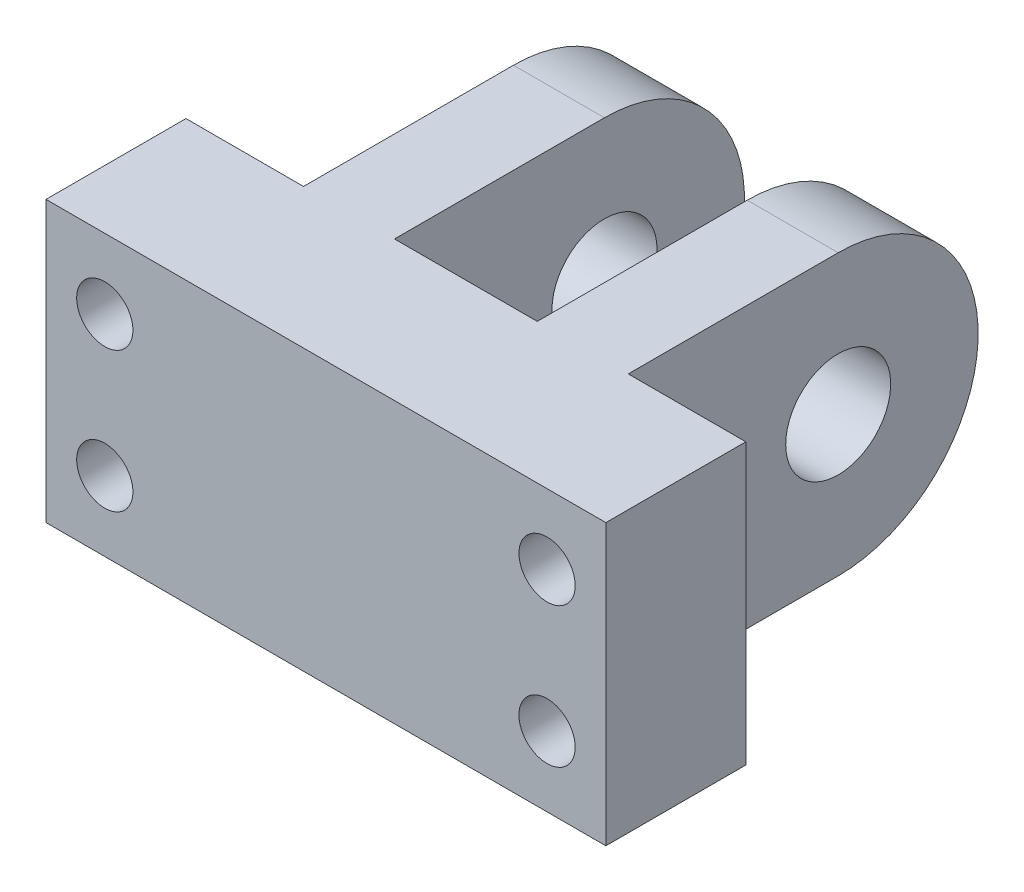
ISO-10303-21;
HEADER;
FILE_DESCRIPTION(('STEP AP214'),'2;1');
FILE_NAME('part.step','',(''),(''),'','','');
FILE_SCHEMA(('AUTOMOTIVE_DESIGN { 1 0 10303 214 1 1 1 1 }'));
ENDSEC;
DATA;
#1=APPLICATION_CONTEXT('core data for automotive mechanical design processes');
#2=APPLICATION_PROTOCOL_DEFINITION('international standard','automotive_design',2000,#1);
#3=PRODUCT_CONTEXT('',#1,'mechanical');
#4=PRODUCT('Part','Part','',(#3));
#5=PRODUCT_RELATED_PRODUCT_CATEGORY('part','',(#4));
#6=PRODUCT_DEFINITION_FORMATION('','',#4);
#7=PRODUCT_DEFINITION_CONTEXT('part definition',#1,'design');
#8=PRODUCT_DEFINITION('design','',#6,#7);
#9=PRODUCT_DEFINITION_SHAPE('','',#8);
#10=(LENGTH_UNIT() NAMED_UNIT(*) SI_UNIT(.MILLI.,.METRE.));
#11=(NAMED_UNIT(*) PLANE_ANGLE_UNIT() SI_UNIT($,.RADIAN.));
#12=(NAMED_UNIT(*) SI_UNIT($,.STERADIAN.) SOLID_ANGLE_UNIT());
#13=UNCERTAINTY_MEASURE_WITH_UNIT(LENGTH_MEASURE(1.E-05),#10,'distance_accuracy_value','');
#14=(GEOMETRIC_REPRESENTATION_CONTEXT(3) GLOBAL_UNCERTAINTY_ASSIGNED_CONTEXT((#13)) GLOBAL_UNIT_ASSIGNED_CONTEXT((#10,
#11,#12)) REPRESENTATION_CONTEXT('',''));
#15=CARTESIAN_POINT('',(0.,0.,0.));
#16=DIRECTION('',(0.,0.,1.));
#17=DIRECTION('',(1.,0.,0.));
#18=AXIS2_PLACEMENT_3D('',#15,#16,#17);
#19=CARTESIAN_POINT('',(50.8,12.7,-31.75));
#20=DIRECTION('',(-1.,0.,0.));
#21=DIRECTION('',(0.,0.,1.));
#22=AXIS2_PLACEMENT_3D('',#19,#20,#21);
#23=CYLINDRICAL_SURFACE('',#22,12.7);
#24=DIRECTION('',(-1.,0.,0.));
#25=VECTOR('',#24,1.);
#26=CARTESIAN_POINT('',(50.8,0.,-31.75));
#27=LINE('',#26,#25);
#28=CARTESIAN_POINT('',(18.923,0.,-31.75));
#29=VERTEX_POINT('',#28);
#30=CARTESIAN_POINT('',(10.668,0.,-31.75));
#31=VERTEX_POINT('',#30);
#32=EDGE_CURVE('E173',#29,#31,#27,.T.);
#33=ORIENTED_EDGE('',*,*,#32,.T.);
#34=CARTESIAN_POINT('',(10.668,12.7,-31.75));
#35=DIRECTION('',(1.,0.,0.));
#36=DIRECTION('',(0.,0.,-1.));
#37=AXIS2_PLACEMENT_3D('',#34,#35,#36);
#38=CIRCLE('',#37,12.7);
#39=CARTESIAN_POINT('',(10.668,25.4,-31.75));
#40=VERTEX_POINT('',#39);
#41=EDGE_CURVE('E165',#31,#40,#38,.T.);
#42=ORIENTED_EDGE('',*,*,#41,.T.);
#43=DIRECTION('',(-1.,0.,0.));
#44=VECTOR('',#43,1.);
#45=CARTESIAN_POINT('',(50.8,25.4,-31.75));
#46=LINE('',#45,#44);
#47=CARTESIAN_POINT('',(18.923,25.4,-31.75));
#48=VERTEX_POINT('',#47);
#49=EDGE_CURVE('E155',#48,#40,#46,.T.);
#50=ORIENTED_EDGE('',*,*,#49,.F.);
#51=CARTESIAN_POINT('',(18.923,12.7,-31.75));
#52=DIRECTION('',(-1.,0.,0.));
#53=DIRECTION('',(0.,0.,1.));
#54=AXIS2_PLACEMENT_3D('',#51,#52,#53);
#55=CIRCLE('',#54,12.7);
#56=EDGE_CURVE('E186',#48,#29,#55,.T.);
#57=ORIENTED_EDGE('',*,*,#56,.T.);
#58=EDGE_LOOP('',(#33,#42,#50,#57));
#59=FACE_BOUND('',#58,.T.);
#60=ADVANCED_FACE('F35',(#59),#23,.T.);
#61=CARTESIAN_POINT('',(50.8,12.7,-31.75));
#62=DIRECTION('',(-1.,0.,0.));
#63=DIRECTION('',(0.,0.,1.));
#64=AXIS2_PLACEMENT_3D('',#61,#62,#63);
#65=PLANE('',#64);
#66=DIRECTION('',(0.,0.,-1.));
#67=VECTOR('',#66,1.);
#68=CARTESIAN_POINT('',(50.8,0.,0.));
#69=LINE('',#68,#67);
#70=CARTESIAN_POINT('',(50.8,0.,0.));
#71=VERTEX_POINT('',#70);
#72=CARTESIAN_POINT('',(50.8,0.,-12.7));
#73=VERTEX_POINT('',#72);
#74=EDGE_CURVE('E147',#71,#73,#69,.T.);
#75=ORIENTED_EDGE('',*,*,#74,.T.);
#76=DIRECTION('',(0.,-1.,0.));
#77=VECTOR('',#76,1.);
#78=CARTESIAN_POINT('',(50.8,25.4,-12.7));
#79=LINE('',#78,#77);
#80=CARTESIAN_POINT('',(50.8,25.4,-12.7));
#81=VERTEX_POINT('',#80);
#82=EDGE_CURVE('E132',#81,#73,#79,.T.);
#83=ORIENTED_EDGE('',*,*,#82,.F.);
#84=DIRECTION('',(0.,0.,1.));
#85=VECTOR('',#84,1.);
#86=CARTESIAN_POINT('',(50.8,25.4,0.));
#87=LINE('',#86,#85);
#88=CARTESIAN_POINT('',(50.8,25.4,0.));
#89=VERTEX_POINT('',#88);
#90=EDGE_CURVE('E145',#81,#89,#87,.T.);
#91=ORIENTED_EDGE('',*,*,#90,.T.);
#92=DIRECTION('',(0.,-1.,0.));
#93=VECTOR('',#92,1.);
#94=CARTESIAN_POINT('',(50.8,0.,0.));
#95=LINE('',#94,#93);
#96=EDGE_CURVE('E157',#89,#71,#95,.T.);
#97=ORIENTED_EDGE('',*,*,#96,.T.);
#98=EDGE_LOOP('',(#75,#83,#91,#97));
#99=FACE_BOUND('',#98,.T.);
#100=ADVANCED_FACE('F143',(#99),#65,.F.);
#101=CARTESIAN_POINT('',(0.,12.7,-31.75));
#102=DIRECTION('',(-1.,0.,0.));
#103=DIRECTION('',(0.,0.,1.));
#104=AXIS2_PLACEMENT_3D('',#101,#102,#103);
#105=PLANE('',#104);
#106=DIRECTION('',(0.,-1.,0.));
#107=VECTOR('',#106,1.);
#108=CARTESIAN_POINT('',(0.,25.4,-12.7));
#109=LINE('',#108,#107);
#110=CARTESIAN_POINT('',(0.,25.4,-12.7));
#111=VERTEX_POINT('',#110);
#112=CARTESIAN_POINT('',(0.,0.,-12.7));
#113=VERTEX_POINT('',#112);
#114=EDGE_CURVE('E180',#111,#113,#109,.T.);
#115=ORIENTED_EDGE('',*,*,#114,.T.);
#116=DIRECTION('',(0.,0.,-1.));
#117=VECTOR('',#116,1.);
#118=CARTESIAN_POINT('',(0.,0.,0.));
#119=LINE('',#118,#117);
#120=CARTESIAN_POINT('',(0.,0.,0.));
#121=VERTEX_POINT('',#120);
#122=EDGE_CURVE('E164',#121,#113,#119,.T.);
#123=ORIENTED_EDGE('',*,*,#122,.F.);
#124=DIRECTION('',(0.,-1.,0.));
#125=VECTOR('',#124,1.);
#126=CARTESIAN_POINT('',(0.,0.,0.));
#127=LINE('',#126,#125);
#128=CARTESIAN_POINT('',(0.,25.4,0.));
#129=VERTEX_POINT('',#128);
#130=EDGE_CURVE('E161',#129,#121,#127,.T.);
#131=ORIENTED_EDGE('',*,*,#130,.F.);
#132=DIRECTION('',(0.,0.,1.));
#133=VECTOR('',#132,1.);
#134=CARTESIAN_POINT('',(0.,25.4,0.));
#135=LINE('',#134,#133);
#136=EDGE_CURVE('E168',#111,#129,#135,.T.);
#137=ORIENTED_EDGE('',*,*,#136,.F.);
#138=EDGE_LOOP('',(#115,#123,#131,#137));
#139=FACE_BOUND('',#138,.T.);
#140=ADVANCED_FACE('F251',(#139),#105,.T.);
#141=CARTESIAN_POINT('',(50.8,0.,0.));
#142=DIRECTION('',(0.,0.,-1.));
#143=DIRECTION('',(-1.,0.,0.));
#144=AXIS2_PLACEMENT_3D('',#141,#142,#143);
#145=PLANE('',#144);
#146=CARTESIAN_POINT('',(45.466,6.34999999999999,0.));
#147=DIRECTION('',(0.,0.,-1.));
#148=DIRECTION('',(0.,1.,0.));
#149=AXIS2_PLACEMENT_3D('',#146,#147,#148);
#150=CIRCLE('',#149,2.5527);
#151=CARTESIAN_POINT('',(45.466,8.90269999999999,0.));
#152=VERTEX_POINT('',#151);
#153=EDGE_CURVE('E372',#152,#152,#150,.T.);
#154=ORIENTED_EDGE('',*,*,#153,.T.);
#155=EDGE_LOOP('',(#154));
#156=FACE_BOUND('',#155,.T.);
#157=CARTESIAN_POINT('',(45.466,19.05,0.));
#158=DIRECTION('',(0.,0.,-1.));
#159=DIRECTION('',(0.,1.,0.));
#160=AXIS2_PLACEMENT_3D('',#157,#158,#159);
#161=CIRCLE('',#160,2.5527);
#162=CARTESIAN_POINT('',(45.466,21.6027,0.));
#163=VERTEX_POINT('',#162);
#164=EDGE_CURVE('E384',#163,#163,#161,.T.);
#165=ORIENTED_EDGE('',*,*,#164,.T.);
#166=EDGE_LOOP('',(#165));
#167=FACE_BOUND('',#166,.T.);
#168=CARTESIAN_POINT('',(5.334,19.05,0.));
#169=DIRECTION('',(0.,0.,-1.));
#170=DIRECTION('',(0.,1.,0.));
#171=AXIS2_PLACEMENT_3D('',#168,#169,#170);
#172=CIRCLE('',#171,2.5527);
#173=CARTESIAN_POINT('',(5.334,21.6027,0.));
#174=VERTEX_POINT('',#173);
#175=EDGE_CURVE('E396',#174,#174,#172,.T.);
#176=ORIENTED_EDGE('',*,*,#175,.T.);
#177=EDGE_LOOP('',(#176));
#178=FACE_BOUND('',#177,.T.);
#179=CARTESIAN_POINT('',(5.334,6.35,0.));
#180=DIRECTION('',(0.,0.,-1.));
#181=DIRECTION('',(0.,1.,0.));
#182=AXIS2_PLACEMENT_3D('',#179,#180,#181);
#183=CIRCLE('',#182,2.5527);
#184=CARTESIAN_POINT('',(5.334,8.9027,0.));
#185=VERTEX_POINT('',#184);
#186=EDGE_CURVE('E208',#185,#185,#183,.T.);
#187=ORIENTED_EDGE('',*,*,#186,.T.);
#188=EDGE_LOOP('',(#187));
#189=FACE_BOUND('',#188,.T.);
#190=ORIENTED_EDGE('',*,*,#130,.T.);
#191=DIRECTION('',(-1.,0.,0.));
#192=VECTOR('',#191,1.);
#193=CARTESIAN_POINT('',(50.8,0.,0.));
#194=LINE('',#193,#192);
#195=EDGE_CURVE('E11',#71,#121,#194,.T.);
#196=ORIENTED_EDGE('',*,*,#195,.F.);
#197=ORIENTED_EDGE('',*,*,#96,.F.);
#198=DIRECTION('',(-1.,0.,0.));
#199=VECTOR('',#198,1.);
#200=CARTESIAN_POINT('',(50.8,25.4,0.));
#201=LINE('',#200,#199);
#202=EDGE_CURVE('E152',#89,#129,#201,.T.);
#203=ORIENTED_EDGE('',*,*,#202,.T.);
#204=EDGE_LOOP('',(#190,#196,#197,#203));
#205=FACE_BOUND('',#204,.T.);
#206=ADVANCED_FACE('F37',(#156,#167,#178,#189,#205),#145,.F.);
#207=CARTESIAN_POINT('',(50.8,0.,0.));
#208=DIRECTION('',(0.,1.,0.));
#209=DIRECTION('',(0.,0.,1.));
#210=AXIS2_PLACEMENT_3D('',#207,#208,#209);
#211=PLANE('',#210);
#212=ORIENTED_EDGE('',*,*,#122,.T.);
#213=DIRECTION('',(-1.,0.,0.));
#214=VECTOR('',#213,1.);
#215=CARTESIAN_POINT('',(10.668,0.,-12.7));
#216=LINE('',#215,#214);
#217=CARTESIAN_POINT('',(10.668,0.,-12.7));
#218=VERTEX_POINT('',#217);
#219=EDGE_CURVE('E139',#218,#113,#216,.T.);
#220=ORIENTED_EDGE('',*,*,#219,.F.);
#221=DIRECTION('',(0.,0.,1.));
#222=VECTOR('',#221,1.);
#223=CARTESIAN_POINT('',(10.668,0.,-44.45));
#224=LINE('',#223,#222);
#225=EDGE_CURVE('E225',#31,#218,#224,.T.);
#226=ORIENTED_EDGE('',*,*,#225,.F.);
#227=ORIENTED_EDGE('',*,*,#32,.F.);
#228=DIRECTION('',(0.,0.,-1.));
#229=VECTOR('',#228,1.);
#230=CARTESIAN_POINT('',(18.923,0.,-12.7));
#231=LINE('',#230,#229);
#232=CARTESIAN_POINT('',(18.923,0.,-12.7));
#233=VERTEX_POINT('',#232);
#234=EDGE_CURVE('E222',#233,#29,#231,.T.);
#235=ORIENTED_EDGE('',*,*,#234,.F.);
#236=DIRECTION('',(-1.,0.,0.));
#237=VECTOR('',#236,1.);
#238=CARTESIAN_POINT('',(31.877,0.,-12.7));
#239=LINE('',#238,#237);
#240=CARTESIAN_POINT('',(31.877,0.,-12.7));
#241=VERTEX_POINT('',#240);
#242=EDGE_CURVE('E219',#241,#233,#239,.T.);
#243=ORIENTED_EDGE('',*,*,#242,.F.);
#244=DIRECTION('',(0.,0.,1.));
#245=VECTOR('',#244,1.);
#246=CARTESIAN_POINT('',(31.877,0.,-44.45));
#247=LINE('',#246,#245);
#248=CARTESIAN_POINT('',(31.877,0.,-31.75));
#249=VERTEX_POINT('',#248);
#250=EDGE_CURVE('E210',#249,#241,#247,.T.);
#251=ORIENTED_EDGE('',*,*,#250,.F.);
#252=CARTESIAN_POINT('',(40.132,0.,-31.75));
#253=VERTEX_POINT('',#252);
#254=EDGE_CURVE('E44',#253,#249,#27,.T.);
#255=ORIENTED_EDGE('',*,*,#254,.F.);
#256=DIRECTION('',(0.,0.,-1.));
#257=VECTOR('',#256,1.);
#258=CARTESIAN_POINT('',(40.132,0.,-12.7));
#259=LINE('',#258,#257);
#260=CARTESIAN_POINT('',(40.132,0.,-12.7));
#261=VERTEX_POINT('',#260);
#262=EDGE_CURVE('E207',#261,#253,#259,.T.);
#263=ORIENTED_EDGE('',*,*,#262,.F.);
#264=DIRECTION('',(-1.,0.,0.));
#265=VECTOR('',#264,1.);
#266=CARTESIAN_POINT('',(50.8,0.,-12.7));
#267=LINE('',#266,#265);
#268=EDGE_CURVE('E204',#73,#261,#267,.T.);
#269=ORIENTED_EDGE('',*,*,#268,.F.);
#270=ORIENTED_EDGE('',*,*,#74,.F.);
#271=ORIENTED_EDGE('',*,*,#195,.T.);
#272=EDGE_LOOP('',(#212,#220,#226,#227,#235,#243,#251,#255,#263,#269,#270,#271));
#273=FACE_BOUND('',#272,.T.);
#274=ADVANCED_FACE('F201',(#273),#211,.F.);
#275=ORIENTED_EDGE('',*,*,#254,.T.);
#276=CARTESIAN_POINT('',(31.877,12.7,-31.75));
#277=DIRECTION('',(1.,0.,0.));
#278=DIRECTION('',(0.,0.,-1.));
#279=AXIS2_PLACEMENT_3D('',#276,#277,#278);
#280=CIRCLE('',#279,12.7);
#281=CARTESIAN_POINT('',(31.877,25.4,-31.75));
#282=VERTEX_POINT('',#281);
#283=EDGE_CURVE('E183',#249,#282,#280,.T.);
#284=ORIENTED_EDGE('',*,*,#283,.T.);
#285=CARTESIAN_POINT('',(40.132,25.4,-31.75));
#286=VERTEX_POINT('',#285);
#287=EDGE_CURVE('E172',#286,#282,#46,.T.);
#288=ORIENTED_EDGE('',*,*,#287,.F.);
#289=CARTESIAN_POINT('',(40.132,12.7,-31.75));
#290=DIRECTION('',(-1.,0.,0.));
#291=DIRECTION('',(0.,0.,1.));
#292=AXIS2_PLACEMENT_3D('',#289,#290,#291);
#293=CIRCLE('',#292,12.7);
#294=EDGE_CURVE('E179',#286,#253,#293,.T.);
#295=ORIENTED_EDGE('',*,*,#294,.T.);
#296=EDGE_LOOP('',(#275,#284,#288,#295));
#297=FACE_BOUND('',#296,.T.);
#298=ADVANCED_FACE('F267',(#297),#23,.T.);
#299=CARTESIAN_POINT('',(50.8,25.4,0.));
#300=DIRECTION('',(0.,-1.,0.));
#301=DIRECTION('',(0.,0.,-1.));
#302=AXIS2_PLACEMENT_3D('',#299,#300,#301);
#303=PLANE('',#302);
#304=DIRECTION('',(0.,0.,1.));
#305=VECTOR('',#304,1.);
#306=CARTESIAN_POINT('',(10.668,25.4,-44.45));
#307=LINE('',#306,#305);
#308=CARTESIAN_POINT('',(10.668,25.4,-12.7));
#309=VERTEX_POINT('',#308);
#310=EDGE_CURVE('E247',#40,#309,#307,.T.);
#311=ORIENTED_EDGE('',*,*,#310,.T.);
#312=DIRECTION('',(-1.,0.,0.));
#313=VECTOR('',#312,1.);
#314=CARTESIAN_POINT('',(10.668,25.4,-12.7));
#315=LINE('',#314,#313);
#316=EDGE_CURVE('E52',#309,#111,#315,.T.);
#317=ORIENTED_EDGE('',*,*,#316,.T.);
#318=ORIENTED_EDGE('',*,*,#136,.T.);
#319=ORIENTED_EDGE('',*,*,#202,.F.);
#320=ORIENTED_EDGE('',*,*,#90,.F.);
#321=DIRECTION('',(-1.,0.,0.));
#322=VECTOR('',#321,1.);
#323=CARTESIAN_POINT('',(50.8,25.4,-12.7));
#324=LINE('',#323,#322);
#325=CARTESIAN_POINT('',(40.132,25.4,-12.7));
#326=VERTEX_POINT('',#325);
#327=EDGE_CURVE('E128',#81,#326,#324,.T.);
#328=ORIENTED_EDGE('',*,*,#327,.T.);
#329=DIRECTION('',(0.,0.,-1.));
#330=VECTOR('',#329,1.);
#331=CARTESIAN_POINT('',(40.132,25.4,-12.7));
#332=LINE('',#331,#330);
#333=EDGE_CURVE('E138',#326,#286,#332,.T.);
#334=ORIENTED_EDGE('',*,*,#333,.T.);
#335=ORIENTED_EDGE('',*,*,#287,.T.);
#336=DIRECTION('',(0.,0.,1.));
#337=VECTOR('',#336,1.);
#338=CARTESIAN_POINT('',(31.877,25.4,-44.45));
#339=LINE('',#338,#337);
#340=CARTESIAN_POINT('',(31.877,25.4,-12.7));
#341=VERTEX_POINT('',#340);
#342=EDGE_CURVE('E239',#282,#341,#339,.T.);
#343=ORIENTED_EDGE('',*,*,#342,.T.);
#344=DIRECTION('',(-1.,0.,0.));
#345=VECTOR('',#344,1.);
#346=CARTESIAN_POINT('',(31.877,25.4,-12.7));
#347=LINE('',#346,#345);
#348=CARTESIAN_POINT('',(18.923,25.4,-12.7));
#349=VERTEX_POINT('',#348);
#350=EDGE_CURVE('E60',#341,#349,#347,.T.);
#351=ORIENTED_EDGE('',*,*,#350,.T.);
#352=DIRECTION('',(0.,0.,-1.));
#353=VECTOR('',#352,1.);
#354=CARTESIAN_POINT('',(18.923,25.4,-12.7));
#355=LINE('',#354,#353);
#356=EDGE_CURVE('E245',#349,#48,#355,.T.);
#357=ORIENTED_EDGE('',*,*,#356,.T.);
#358=ORIENTED_EDGE('',*,*,#49,.T.);
#359=EDGE_LOOP('',(#311,#317,#318,#319,#320,#328,#334,#335,#343,#351,#357,#358));
#360=FACE_BOUND('',#359,.T.);
#361=ADVANCED_FACE('F150',(#360),#303,.F.);
#362=CARTESIAN_POINT('',(40.132,25.4,-12.7));
#363=DIRECTION('',(-1.,0.,0.));
#364=DIRECTION('',(0.,0.,1.));
#365=AXIS2_PLACEMENT_3D('',#362,#363,#364);
#366=PLANE('',#365);
#367=CARTESIAN_POINT('',(40.132,12.7,-31.75));
#368=DIRECTION('',(-1.,0.,0.));
#369=DIRECTION('',(0.,0.,1.));
#370=AXIS2_PLACEMENT_3D('',#367,#368,#369);
#371=CIRCLE('',#370,4.7625);
#372=CARTESIAN_POINT('',(40.132,12.7,-26.9875));
#373=VERTEX_POINT('',#372);
#374=EDGE_CURVE('E176',#373,#373,#371,.T.);
#375=ORIENTED_EDGE('',*,*,#374,.T.);
#376=EDGE_LOOP('',(#375));
#377=FACE_BOUND('',#376,.T.);
#378=ORIENTED_EDGE('',*,*,#333,.F.);
#379=DIRECTION('',(0.,-1.,0.));
#380=VECTOR('',#379,1.);
#381=CARTESIAN_POINT('',(40.132,25.4,-12.7));
#382=LINE('',#381,#380);
#383=EDGE_CURVE('E134',#326,#261,#382,.T.);
#384=ORIENTED_EDGE('',*,*,#383,.T.);
#385=ORIENTED_EDGE('',*,*,#262,.T.);
#386=ORIENTED_EDGE('',*,*,#294,.F.);
#387=EDGE_LOOP('',(#378,#384,#385,#386));
#388=FACE_BOUND('',#387,.T.);
#389=ADVANCED_FACE('F237',(#377,#388),#366,.F.);
#390=CARTESIAN_POINT('',(50.8,25.4,-12.7));
#391=DIRECTION('',(0.,0.,1.));
#392=DIRECTION('',(0.,-1.,0.));
#393=AXIS2_PLACEMENT_3D('',#390,#391,#392);
#394=PLANE('',#393);
#395=CARTESIAN_POINT('',(45.466,6.34999999999999,-12.7));
#396=DIRECTION('',(0.,0.,-1.));
#397=DIRECTION('',(0.,1.,0.));
#398=AXIS2_PLACEMENT_3D('',#395,#396,#397);
#399=CIRCLE('',#398,4.7625);
#400=CARTESIAN_POINT('',(45.466,11.1125,-12.7));
#401=VERTEX_POINT('',#400);
#402=EDGE_CURVE('E365',#401,#401,#399,.T.);
#403=ORIENTED_EDGE('',*,*,#402,.F.);
#404=EDGE_LOOP('',(#403));
#405=FACE_BOUND('',#404,.T.);
#406=CARTESIAN_POINT('',(45.466,19.05,-12.7));
#407=DIRECTION('',(0.,0.,-1.));
#408=DIRECTION('',(0.,1.,0.));
#409=AXIS2_PLACEMENT_3D('',#406,#407,#408);
#410=CIRCLE('',#409,4.7625);
#411=CARTESIAN_POINT('',(45.466,23.8125,-12.7));
#412=VERTEX_POINT('',#411);
#413=EDGE_CURVE('E375',#412,#412,#410,.T.);
#414=ORIENTED_EDGE('',*,*,#413,.F.);
#415=EDGE_LOOP('',(#414));
#416=FACE_BOUND('',#415,.T.);
#417=ORIENTED_EDGE('',*,*,#268,.T.);
#418=ORIENTED_EDGE('',*,*,#383,.F.);
#419=ORIENTED_EDGE('',*,*,#327,.F.);
#420=ORIENTED_EDGE('',*,*,#82,.T.);
#421=EDGE_LOOP('',(#417,#418,#419,#420));
#422=FACE_BOUND('',#421,.T.);
#423=ADVANCED_FACE('F131',(#405,#416,#422),#394,.F.);
#424=CARTESIAN_POINT('',(18.923,25.4,-12.7));
#425=DIRECTION('',(-1.,0.,0.));
#426=DIRECTION('',(0.,0.,1.));
#427=AXIS2_PLACEMENT_3D('',#424,#425,#426);
#428=PLANE('',#427);
#429=CARTESIAN_POINT('',(18.923,12.7,-31.75));
#430=DIRECTION('',(-1.,0.,0.));
#431=DIRECTION('',(0.,0.,1.));
#432=AXIS2_PLACEMENT_3D('',#429,#430,#431);
#433=CIRCLE('',#432,4.7625);
#434=CARTESIAN_POINT('',(18.923,12.7,-26.9875));
#435=VERTEX_POINT('',#434);
#436=EDGE_CURVE('E184',#435,#435,#433,.T.);
#437=ORIENTED_EDGE('',*,*,#436,.T.);
#438=EDGE_LOOP('',(#437));
#439=FACE_BOUND('',#438,.T.);
#440=ORIENTED_EDGE('',*,*,#356,.F.);
#441=DIRECTION('',(0.,-1.,0.));
#442=VECTOR('',#441,1.);
#443=CARTESIAN_POINT('',(18.923,25.4,-12.7));
#444=LINE('',#443,#442);
#445=EDGE_CURVE('E232',#349,#233,#444,.T.);
#446=ORIENTED_EDGE('',*,*,#445,.T.);
#447=ORIENTED_EDGE('',*,*,#234,.T.);
#448=ORIENTED_EDGE('',*,*,#56,.F.);
#449=EDGE_LOOP('',(#440,#446,#447,#448));
#450=FACE_BOUND('',#449,.T.);
#451=ADVANCED_FACE('F261',(#439,#450),#428,.F.);
#452=CARTESIAN_POINT('',(31.877,25.4,-44.45));
#453=DIRECTION('',(1.,0.,0.));
#454=DIRECTION('',(0.,0.,-1.));
#455=AXIS2_PLACEMENT_3D('',#452,#453,#454);
#456=PLANE('',#455);
#457=CARTESIAN_POINT('',(31.877,12.7,-31.75));
#458=DIRECTION('',(1.,0.,0.));
#459=DIRECTION('',(0.,0.,-1.));
#460=AXIS2_PLACEMENT_3D('',#457,#458,#459);
#461=CIRCLE('',#460,4.7625);
#462=CARTESIAN_POINT('',(31.877,12.7,-36.5125));
#463=VERTEX_POINT('',#462);
#464=EDGE_CURVE('E181',#463,#463,#461,.T.);
#465=ORIENTED_EDGE('',*,*,#464,.T.);
#466=EDGE_LOOP('',(#465));
#467=FACE_BOUND('',#466,.T.);
#468=ORIENTED_EDGE('',*,*,#283,.F.);
#469=ORIENTED_EDGE('',*,*,#250,.T.);
#470=DIRECTION('',(0.,-1.,0.));
#471=VECTOR('',#470,1.);
#472=CARTESIAN_POINT('',(31.877,25.4,-12.7));
#473=LINE('',#472,#471);
#474=EDGE_CURVE('E234',#341,#241,#473,.T.);
#475=ORIENTED_EDGE('',*,*,#474,.F.);
#476=ORIENTED_EDGE('',*,*,#342,.F.);
#477=EDGE_LOOP('',(#468,#469,#475,#476));
#478=FACE_BOUND('',#477,.T.);
#479=ADVANCED_FACE('F266',(#467,#478),#456,.F.);
#480=CARTESIAN_POINT('',(31.877,25.4,-12.7));
#481=DIRECTION('',(0.,0.,1.));
#482=DIRECTION('',(0.,-1.,0.));
#483=AXIS2_PLACEMENT_3D('',#480,#481,#482);
#484=PLANE('',#483);
#485=ORIENTED_EDGE('',*,*,#242,.T.);
#486=ORIENTED_EDGE('',*,*,#445,.F.);
#487=ORIENTED_EDGE('',*,*,#350,.F.);
#488=ORIENTED_EDGE('',*,*,#474,.T.);
#489=EDGE_LOOP('',(#485,#486,#487,#488));
#490=FACE_BOUND('',#489,.T.);
#491=ADVANCED_FACE('F264',(#490),#484,.F.);
#492=CARTESIAN_POINT('',(50.8,12.7,-31.75));
#493=DIRECTION('',(-1.,0.,0.));
#494=DIRECTION('',(0.,0.,1.));
#495=AXIS2_PLACEMENT_3D('',#492,#493,#494);
#496=CYLINDRICAL_SURFACE('',#495,4.7625);
#497=CARTESIAN_POINT('',(10.668,12.7,-31.75));
#498=DIRECTION('',(1.,0.,0.));
#499=DIRECTION('',(0.,0.,-1.));
#500=AXIS2_PLACEMENT_3D('',#497,#498,#499);
#501=CIRCLE('',#500,4.7625);
#502=CARTESIAN_POINT('',(10.668,12.7,-36.5125));
#503=VERTEX_POINT('',#502);
#504=EDGE_CURVE('E39',#503,#503,#501,.T.);
#505=ORIENTED_EDGE('',*,*,#504,.F.);
#506=EDGE_LOOP('',(#505));
#507=FACE_BOUND('',#506,.T.);
#508=ORIENTED_EDGE('',*,*,#436,.F.);
#509=EDGE_LOOP('',(#508));
#510=FACE_BOUND('',#509,.T.);
#511=ADVANCED_FACE('F290',(#507,#510),#496,.F.);
#512=CARTESIAN_POINT('',(10.668,25.4,-44.45));
#513=DIRECTION('',(1.,0.,0.));
#514=DIRECTION('',(0.,0.,-1.));
#515=AXIS2_PLACEMENT_3D('',#512,#513,#514);
#516=PLANE('',#515);
#517=ORIENTED_EDGE('',*,*,#504,.T.);
#518=EDGE_LOOP('',(#517));
#519=FACE_BOUND('',#518,.T.);
#520=ORIENTED_EDGE('',*,*,#41,.F.);
#521=ORIENTED_EDGE('',*,*,#225,.T.);
#522=DIRECTION('',(0.,-1.,0.));
#523=VECTOR('',#522,1.);
#524=CARTESIAN_POINT('',(10.668,25.4,-12.7));
#525=LINE('',#524,#523);
#526=EDGE_CURVE('E230',#309,#218,#525,.T.);
#527=ORIENTED_EDGE('',*,*,#526,.F.);
#528=ORIENTED_EDGE('',*,*,#310,.F.);
#529=EDGE_LOOP('',(#520,#521,#527,#528));
#530=FACE_BOUND('',#529,.T.);
#531=ADVANCED_FACE('F304',(#519,#530),#516,.F.);
#532=CARTESIAN_POINT('',(10.668,25.4,-12.7));
#533=DIRECTION('',(0.,0.,1.));
#534=DIRECTION('',(0.,-1.,0.));
#535=AXIS2_PLACEMENT_3D('',#532,#533,#534);
#536=PLANE('',#535);
#537=CARTESIAN_POINT('',(5.334,19.05,-12.7));
#538=DIRECTION('',(0.,0.,-1.));
#539=DIRECTION('',(0.,1.,0.));
#540=AXIS2_PLACEMENT_3D('',#537,#538,#539);
#541=CIRCLE('',#540,4.7625);
#542=CARTESIAN_POINT('',(5.334,23.8125,-12.7));
#543=VERTEX_POINT('',#542);
#544=EDGE_CURVE('E387',#543,#543,#541,.T.);
#545=ORIENTED_EDGE('',*,*,#544,.F.);
#546=EDGE_LOOP('',(#545));
#547=FACE_BOUND('',#546,.T.);
#548=CARTESIAN_POINT('',(5.334,6.35,-12.7));
#549=DIRECTION('',(0.,0.,-1.));
#550=DIRECTION('',(0.,1.,0.));
#551=AXIS2_PLACEMENT_3D('',#548,#549,#550);
#552=CIRCLE('',#551,4.7625);
#553=CARTESIAN_POINT('',(5.334,11.1125,-12.7));
#554=VERTEX_POINT('',#553);
#555=EDGE_CURVE('E399',#554,#554,#552,.T.);
#556=ORIENTED_EDGE('',*,*,#555,.F.);
#557=EDGE_LOOP('',(#556));
#558=FACE_BOUND('',#557,.T.);
#559=ORIENTED_EDGE('',*,*,#219,.T.);
#560=ORIENTED_EDGE('',*,*,#114,.F.);
#561=ORIENTED_EDGE('',*,*,#316,.F.);
#562=ORIENTED_EDGE('',*,*,#526,.T.);
#563=EDGE_LOOP('',(#559,#560,#561,#562));
#564=FACE_BOUND('',#563,.T.);
#565=ADVANCED_FACE('F252',(#547,#558,#564),#536,.F.);
#566=ORIENTED_EDGE('',*,*,#464,.F.);
#567=EDGE_LOOP('',(#566));
#568=FACE_BOUND('',#567,.T.);
#569=ORIENTED_EDGE('',*,*,#374,.F.);
#570=EDGE_LOOP('',(#569));
#571=FACE_BOUND('',#570,.T.);
#572=ADVANCED_FACE('F285',(#568,#571),#496,.F.);
#573=CARTESIAN_POINT('',(5.334,6.35,-12.7));
#574=DIRECTION('',(0.,0.,-1.));
#575=DIRECTION('',(0.,1.,0.));
#576=AXIS2_PLACEMENT_3D('',#573,#574,#575);
#577=CYLINDRICAL_SURFACE('',#576,2.5527);
#578=ORIENTED_EDGE('',*,*,#186,.F.);
#579=EDGE_LOOP('',(#578));
#580=FACE_BOUND('',#579,.T.);
#581=CARTESIAN_POINT('',(5.334,6.35,-7.874));
#582=DIRECTION('',(0.,0.,-1.));
#583=DIRECTION('',(0.,1.,0.));
#584=AXIS2_PLACEMENT_3D('',#581,#582,#583);
#585=CIRCLE('',#584,2.5527);
#586=CARTESIAN_POINT('',(5.334,8.9027,-7.874));
#587=VERTEX_POINT('',#586);
#588=EDGE_CURVE('E213',#587,#587,#585,.T.);
#589=ORIENTED_EDGE('',*,*,#588,.T.);
#590=EDGE_LOOP('',(#589));
#591=FACE_BOUND('',#590,.T.);
#592=ADVANCED_FACE('F288',(#580,#591),#577,.F.);
#593=CARTESIAN_POINT('',(7.8867,6.35,-7.874));
#594=DIRECTION('',(0.,0.,1.));
#595=DIRECTION('',(0.,-1.,0.));
#596=AXIS2_PLACEMENT_3D('',#593,#594,#595);
#597=PLANE('',#596);
#598=ORIENTED_EDGE('',*,*,#588,.F.);
#599=EDGE_LOOP('',(#598));
#600=FACE_BOUND('',#599,.T.);
#601=CARTESIAN_POINT('',(5.334,6.35,-7.874));
#602=DIRECTION('',(0.,0.,-1.));
#603=DIRECTION('',(0.,1.,0.));
#604=AXIS2_PLACEMENT_3D('',#601,#602,#603);
#605=CIRCLE('',#604,4.7625);
#606=CARTESIAN_POINT('',(5.334,11.1125,-7.874));
#607=VERTEX_POINT('',#606);
#608=EDGE_CURVE('E402',#607,#607,#605,.T.);
#609=ORIENTED_EDGE('',*,*,#608,.T.);
#610=EDGE_LOOP('',(#609));
#611=FACE_BOUND('',#610,.T.);
#612=ADVANCED_FACE('F313',(#600,#611),#597,.F.);
#613=CARTESIAN_POINT('',(5.334,6.35,-12.7));
#614=DIRECTION('',(0.,0.,-1.));
#615=DIRECTION('',(0.,1.,0.));
#616=AXIS2_PLACEMENT_3D('',#613,#614,#615);
#617=CYLINDRICAL_SURFACE('',#616,4.7625);
#618=ORIENTED_EDGE('',*,*,#608,.F.);
#619=EDGE_LOOP('',(#618));
#620=FACE_BOUND('',#619,.T.);
#621=ORIENTED_EDGE('',*,*,#555,.T.);
#622=EDGE_LOOP('',(#621));
#623=FACE_BOUND('',#622,.T.);
#624=ADVANCED_FACE('F317',(#620,#623),#617,.F.);
#625=CARTESIAN_POINT('',(5.334,19.05,-12.7));
#626=DIRECTION('',(0.,0.,-1.));
#627=DIRECTION('',(0.,1.,0.));
#628=AXIS2_PLACEMENT_3D('',#625,#626,#627);
#629=CYLINDRICAL_SURFACE('',#628,2.5527);
#630=ORIENTED_EDGE('',*,*,#175,.F.);
#631=EDGE_LOOP('',(#630));
#632=FACE_BOUND('',#631,.T.);
#633=CARTESIAN_POINT('',(5.334,19.05,-7.874));
#634=DIRECTION('',(0.,0.,-1.));
#635=DIRECTION('',(0.,1.,0.));
#636=AXIS2_PLACEMENT_3D('',#633,#634,#635);
#637=CIRCLE('',#636,2.5527);
#638=CARTESIAN_POINT('',(5.334,21.6027,-7.874));
#639=VERTEX_POINT('',#638);
#640=EDGE_CURVE('E393',#639,#639,#637,.T.);
#641=ORIENTED_EDGE('',*,*,#640,.T.);
#642=EDGE_LOOP('',(#641));
#643=FACE_BOUND('',#642,.T.);
#644=ADVANCED_FACE('F321',(#632,#643),#629,.F.);
#645=CARTESIAN_POINT('',(7.8867,19.05,-7.874));
#646=DIRECTION('',(0.,0.,1.));
#647=DIRECTION('',(0.,-1.,0.));
#648=AXIS2_PLACEMENT_3D('',#645,#646,#647);
#649=PLANE('',#648);
#650=ORIENTED_EDGE('',*,*,#640,.F.);
#651=EDGE_LOOP('',(#650));
#652=FACE_BOUND('',#651,.T.);
#653=CARTESIAN_POINT('',(5.334,19.05,-7.874));
#654=DIRECTION('',(0.,0.,-1.));
#655=DIRECTION('',(0.,1.,0.));
#656=AXIS2_PLACEMENT_3D('',#653,#654,#655);
#657=CIRCLE('',#656,4.7625);
#658=CARTESIAN_POINT('',(5.334,23.8125,-7.874));
#659=VERTEX_POINT('',#658);
#660=EDGE_CURVE('E390',#659,#659,#657,.T.);
#661=ORIENTED_EDGE('',*,*,#660,.T.);
#662=EDGE_LOOP('',(#661));
#663=FACE_BOUND('',#662,.T.);
#664=ADVANCED_FACE('F325',(#652,#663),#649,.F.);
#665=CARTESIAN_POINT('',(5.334,19.05,-12.7));
#666=DIRECTION('',(0.,0.,-1.));
#667=DIRECTION('',(0.,1.,0.));
#668=AXIS2_PLACEMENT_3D('',#665,#666,#667);
#669=CYLINDRICAL_SURFACE('',#668,4.7625);
#670=ORIENTED_EDGE('',*,*,#660,.F.);
#671=EDGE_LOOP('',(#670));
#672=FACE_BOUND('',#671,.T.);
#673=ORIENTED_EDGE('',*,*,#544,.T.);
#674=EDGE_LOOP('',(#673));
#675=FACE_BOUND('',#674,.T.);
#676=ADVANCED_FACE('F329',(#672,#675),#669,.F.);
#677=CARTESIAN_POINT('',(45.466,19.05,-12.7));
#678=DIRECTION('',(0.,0.,-1.));
#679=DIRECTION('',(0.,1.,0.));
#680=AXIS2_PLACEMENT_3D('',#677,#678,#679);
#681=CYLINDRICAL_SURFACE('',#680,2.5527);
#682=ORIENTED_EDGE('',*,*,#164,.F.);
#683=EDGE_LOOP('',(#682));
#684=FACE_BOUND('',#683,.T.);
#685=CARTESIAN_POINT('',(45.466,19.05,-7.874));
#686=DIRECTION('',(0.,0.,-1.));
#687=DIRECTION('',(0.,1.,0.));
#688=AXIS2_PLACEMENT_3D('',#685,#686,#687);
#689=CIRCLE('',#688,2.5527);
#690=CARTESIAN_POINT('',(45.466,21.6027,-7.874));
#691=VERTEX_POINT('',#690);
#692=EDGE_CURVE('E381',#691,#691,#689,.T.);
#693=ORIENTED_EDGE('',*,*,#692,.T.);
#694=EDGE_LOOP('',(#693));
#695=FACE_BOUND('',#694,.T.);
#696=ADVANCED_FACE('F333',(#684,#695),#681,.F.);
#697=CARTESIAN_POINT('',(48.0187,19.05,-7.874));
#698=DIRECTION('',(0.,0.,1.));
#699=DIRECTION('',(0.,-1.,0.));
#700=AXIS2_PLACEMENT_3D('',#697,#698,#699);
#701=PLANE('',#700);
#702=ORIENTED_EDGE('',*,*,#692,.F.);
#703=EDGE_LOOP('',(#702));
#704=FACE_BOUND('',#703,.T.);
#705=CARTESIAN_POINT('',(45.466,19.05,-7.874));
#706=DIRECTION('',(0.,0.,-1.));
#707=DIRECTION('',(0.,1.,0.));
#708=AXIS2_PLACEMENT_3D('',#705,#706,#707);
#709=CIRCLE('',#708,4.7625);
#710=CARTESIAN_POINT('',(45.466,23.8125,-7.874));
#711=VERTEX_POINT('',#710);
#712=EDGE_CURVE('E378',#711,#711,#709,.T.);
#713=ORIENTED_EDGE('',*,*,#712,.T.);
#714=EDGE_LOOP('',(#713));
#715=FACE_BOUND('',#714,.T.);
#716=ADVANCED_FACE('F337',(#704,#715),#701,.F.);
#717=CARTESIAN_POINT('',(45.466,19.05,-12.7));
#718=DIRECTION('',(0.,0.,-1.));
#719=DIRECTION('',(0.,1.,0.));
#720=AXIS2_PLACEMENT_3D('',#717,#718,#719);
#721=CYLINDRICAL_SURFACE('',#720,4.7625);
#722=ORIENTED_EDGE('',*,*,#712,.F.);
#723=EDGE_LOOP('',(#722));
#724=FACE_BOUND('',#723,.T.);
#725=ORIENTED_EDGE('',*,*,#413,.T.);
#726=EDGE_LOOP('',(#725));
#727=FACE_BOUND('',#726,.T.);
#728=ADVANCED_FACE('F341',(#724,#727),#721,.F.);
#729=CARTESIAN_POINT('',(45.466,6.34999999999999,-12.7));
#730=DIRECTION('',(0.,0.,-1.));
#731=DIRECTION('',(0.,1.,0.));
#732=AXIS2_PLACEMENT_3D('',#729,#730,#731);
#733=CYLINDRICAL_SURFACE('',#732,2.5527);
#734=ORIENTED_EDGE('',*,*,#153,.F.);
#735=EDGE_LOOP('',(#734));
#736=FACE_BOUND('',#735,.T.);
#737=CARTESIAN_POINT('',(45.466,6.34999999999999,-7.874));
#738=DIRECTION('',(0.,0.,-1.));
#739=DIRECTION('',(0.,1.,0.));
#740=AXIS2_PLACEMENT_3D('',#737,#738,#739);
#741=CIRCLE('',#740,2.5527);
#742=CARTESIAN_POINT('',(45.466,8.90269999999999,-7.874));
#743=VERTEX_POINT('',#742);
#744=EDGE_CURVE('E367',#743,#743,#741,.T.);
#745=ORIENTED_EDGE('',*,*,#744,.T.);
#746=EDGE_LOOP('',(#745));
#747=FACE_BOUND('',#746,.T.);
#748=ADVANCED_FACE('F345',(#736,#747),#733,.F.);
#749=CARTESIAN_POINT('',(48.0187,6.34999999999999,-7.874));
#750=DIRECTION('',(0.,0.,1.));
#751=DIRECTION('',(0.,-1.,0.));
#752=AXIS2_PLACEMENT_3D('',#749,#750,#751);
#753=PLANE('',#752);
#754=ORIENTED_EDGE('',*,*,#744,.F.);
#755=EDGE_LOOP('',(#754));
#756=FACE_BOUND('',#755,.T.);
#757=CARTESIAN_POINT('',(45.466,6.34999999999999,-7.874));
#758=DIRECTION('',(0.,0.,-1.));
#759=DIRECTION('',(0.,1.,0.));
#760=AXIS2_PLACEMENT_3D('',#757,#758,#759);
#761=CIRCLE('',#760,4.7625);
#762=CARTESIAN_POINT('',(45.466,11.1125,-7.874));
#763=VERTEX_POINT('',#762);
#764=EDGE_CURVE('E362',#763,#763,#761,.T.);
#765=ORIENTED_EDGE('',*,*,#764,.T.);
#766=EDGE_LOOP('',(#765));
#767=FACE_BOUND('',#766,.T.);
#768=ADVANCED_FACE('F349',(#756,#767),#753,.F.);
#769=CARTESIAN_POINT('',(45.466,6.34999999999999,-12.7));
#770=DIRECTION('',(0.,0.,-1.));
#771=DIRECTION('',(0.,1.,0.));
#772=AXIS2_PLACEMENT_3D('',#769,#770,#771);
#773=CYLINDRICAL_SURFACE('',#772,4.7625);
#774=ORIENTED_EDGE('',*,*,#764,.F.);
#775=EDGE_LOOP('',(#774));
#776=FACE_BOUND('',#775,.T.);
#777=ORIENTED_EDGE('',*,*,#402,.T.);
#778=EDGE_LOOP('',(#777));
#779=FACE_BOUND('',#778,.T.);
#780=ADVANCED_FACE('F353',(#776,#779),#773,.F.);
#781=CLOSED_SHELL('',(#60,#100,#140,#206,#274,#298,#361,#389,#423,#451,#479,#491,#511,#531,#565,
#572,#592,#612,#624,#644,#664,#676,#696,#716,#728,#748,#768,#780));
#782=MANIFOLD_SOLID_BREP('B2',#781);
#783=ADVANCED_BREP_SHAPE_REPRESENTATION('',(#18,#782),#14);
#784=SHAPE_DEFINITION_REPRESENTATION(#9,#783);
ENDSEC;
END-ISO-10303-21;
